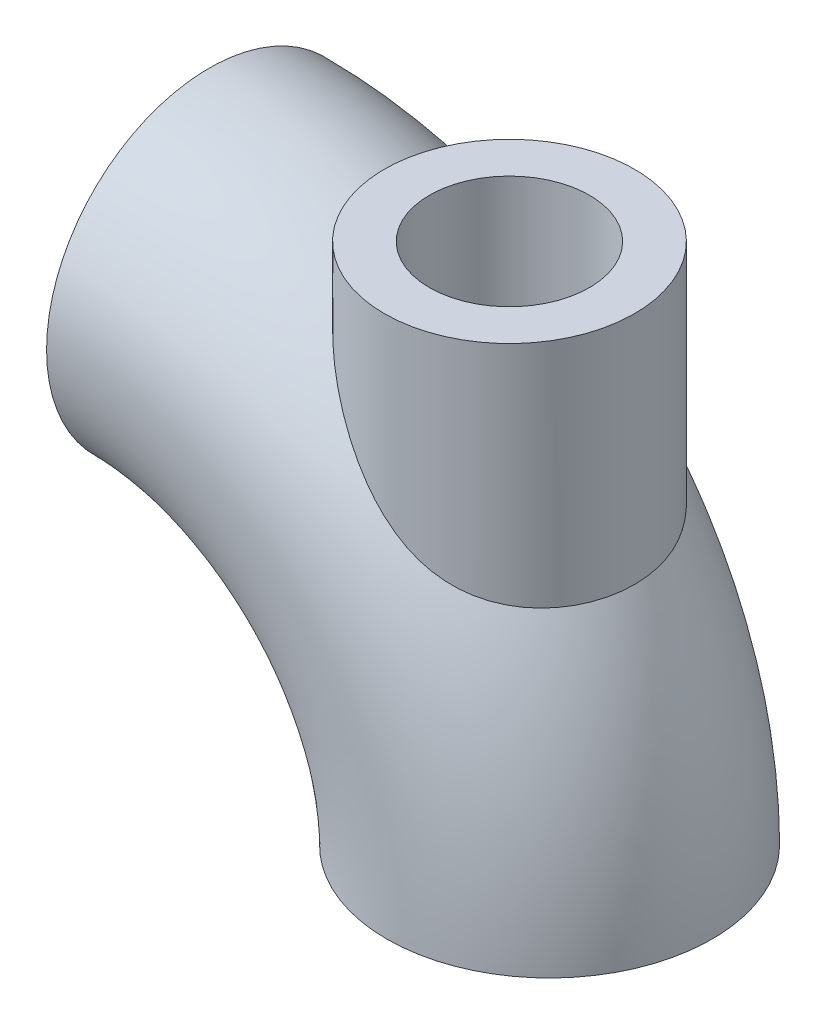
ISO-10303-21;
HEADER;
FILE_DESCRIPTION(('STEP AP214'),'2;1');
FILE_NAME('part.step','',(''),(''),'','','');
FILE_SCHEMA(('AUTOMOTIVE_DESIGN { 1 0 10303 214 1 1 1 1 }'));
ENDSEC;
DATA;
#1=APPLICATION_CONTEXT('core data for automotive mechanical design processes');
#2=APPLICATION_PROTOCOL_DEFINITION('international standard','automotive_design',2000,#1);
#3=PRODUCT_CONTEXT('',#1,'mechanical');
#4=PRODUCT('Part','Part','',(#3));
#5=PRODUCT_RELATED_PRODUCT_CATEGORY('part','',(#4));
#6=PRODUCT_DEFINITION_FORMATION('','',#4);
#7=PRODUCT_DEFINITION_CONTEXT('part definition',#1,'design');
#8=PRODUCT_DEFINITION('design','',#6,#7);
#9=PRODUCT_DEFINITION_SHAPE('','',#8);
#10=(LENGTH_UNIT() NAMED_UNIT(*) SI_UNIT(.MILLI.,.METRE.));
#11=(NAMED_UNIT(*) PLANE_ANGLE_UNIT() SI_UNIT($,.RADIAN.));
#12=(NAMED_UNIT(*) SI_UNIT($,.STERADIAN.) SOLID_ANGLE_UNIT());
#13=UNCERTAINTY_MEASURE_WITH_UNIT(LENGTH_MEASURE(1.E-05),#10,'distance_accuracy_value','');
#14=(GEOMETRIC_REPRESENTATION_CONTEXT(3) GLOBAL_UNCERTAINTY_ASSIGNED_CONTEXT((#13)) GLOBAL_UNIT_ASSIGNED_CONTEXT((#10,
#11,#12)) REPRESENTATION_CONTEXT('',''));
#15=CARTESIAN_POINT('',(0.,0.,0.));
#16=DIRECTION('',(0.,0.,1.));
#17=DIRECTION('',(1.,0.,0.));
#18=AXIS2_PLACEMENT_3D('',#15,#16,#17);
#19=CARTESIAN_POINT('',(-68.,0.,0.));
#20=DIRECTION('',(0.,0.,-1.));
#21=DIRECTION('',(-1.,0.,0.));
#22=AXIS2_PLACEMENT_3D('',#19,#20,#21);
#23=TOROIDAL_SURFACE('',#22,68.,20.);
#24=CARTESIAN_POINT('',(0.251674053511512,46.458689869364,-13.7080222977133));
#25=CARTESIAN_POINT('',(0.579883240702387,46.3070119127707,-13.5104488063518));
#26=CARTESIAN_POINT('',(0.905013391545234,46.1670687579967,-13.2986413226634));
#27=CARTESIAN_POINT('',(1.54464572796947,45.9092450303312,-12.8472967635571));
#28=CARTESIAN_POINT('',(1.85914572640486,45.7913689753574,-12.6077540259615));
#29=CARTESIAN_POINT('',(2.47374917285592,45.5755106213001,-12.1020291615279));
#30=CARTESIAN_POINT('',(2.77383773467794,45.4775485684441,-11.8358203300164));
#31=CARTESIAN_POINT('',(3.35573844524039,45.2992868907994,-11.278717478387));
#32=CARTESIAN_POINT('',(3.63755110468632,45.218986772312,-10.9878241485826));
#33=CARTESIAN_POINT('',(4.17893705828471,45.0738773580956,-10.3844685151367));
#34=CARTESIAN_POINT('',(4.43858871496309,45.0090118937554,-10.0720899223983));
#35=CARTESIAN_POINT('',(4.93437406613024,44.8921118118886,-9.42695517497418));
#36=CARTESIAN_POINT('',(5.17050774611197,44.8400772022766,-9.0941990077188));
#37=CARTESIAN_POINT('',(5.6172299845286,44.7467934258441,-8.41057483469467));
#38=CARTESIAN_POINT('',(5.82782055034193,44.7055434111906,-8.05970825527766));
#39=CARTESIAN_POINT('',(6.22183446259688,44.6320503406775,-7.34213753203489));
#40=CARTESIAN_POINT('',(6.40525706078586,44.5998075328702,-6.97543295236244));
#41=CARTESIAN_POINT('',(6.75119795513024,44.5415616920485,-6.21173769331107));
#42=CARTESIAN_POINT('',(6.91240592914686,44.515904300189,-5.81412658614216));
#43=CARTESIAN_POINT('',(7.20246403487503,44.4714324792229,-5.00689956902898));
#44=CARTESIAN_POINT('',(7.33131335062423,44.4526182226688,-4.59728335665238));
#45=CARTESIAN_POINT('',(7.55572947632467,44.4207792619524,-3.76875426039018));
#46=CARTESIAN_POINT('',(7.65129178795772,44.407755340215,-3.34984012813846));
#47=CARTESIAN_POINT('',(7.8084329024644,44.3867453121045,-2.50556100270997));
#48=CARTESIAN_POINT('',(7.87001121970057,44.3787592777234,-2.08019591743714));
#49=CARTESIAN_POINT('',(7.96022157242804,44.3671599445565,-1.21168523134526));
#50=CARTESIAN_POINT('',(7.9876962824221,44.3637000452235,-0.768416944184042));
#51=CARTESIAN_POINT('',(8.00571104486699,44.361424519783,0.118888199153371));
#52=CARTESIAN_POINT('',(7.99625019030276,44.3626090077262,0.562925073935881));
#53=CARTESIAN_POINT('',(7.94046032816614,44.3696996156558,1.44867162025102));
#54=CARTESIAN_POINT('',(7.89412875588161,44.3756060641,1.89038112774131));
#55=CARTESIAN_POINT('',(7.7649370415422,44.3925198313372,2.76832607859729));
#56=CARTESIAN_POINT('',(7.68207700046105,44.4035271360303,3.20456153709116));
#57=CARTESIAN_POINT('',(7.47993001707069,44.431405126257,4.07069267080586));
#58=CARTESIAN_POINT('',(7.36045789574553,44.4483056803984,4.5005441936349));
#59=CARTESIAN_POINT('',(7.08616001791351,44.4889954130157,5.3484891406377));
#60=CARTESIAN_POINT('',(6.93133393339869,44.5127846554044,5.76658245568042));
#61=CARTESIAN_POINT('',(6.58754180933493,44.5686527300031,6.58801081519642));
#62=CARTESIAN_POINT('',(6.39856970715237,44.6007330347292,6.99134322354989));
#63=CARTESIAN_POINT('',(5.98810213854316,44.6749603221657,7.78014490477518));
#64=CARTESIAN_POINT('',(5.76660706506272,44.7171071832547,8.16561439339479));
#65=CARTESIAN_POINT('',(5.29568831337472,44.8131171790887,8.91162755466653));
#66=CARTESIAN_POINT('',(5.04659635255148,44.8668472211078,9.2723976148262));
#67=CARTESIAN_POINT('',(4.52096109455018,44.9887678618065,9.97078315627513));
#68=CARTESIAN_POINT('',(4.24441773106717,45.0569584954141,10.3083985816343));
#69=CARTESIAN_POINT('',(3.66701628223523,45.2105525486959,10.957614761564));
#70=CARTESIAN_POINT('',(3.36617252740645,45.2959458672943,11.2692306314129));
#71=CARTESIAN_POINT('',(2.74365681901244,45.4869434590673,11.8641964013391));
#72=CARTESIAN_POINT('',(2.4219863255067,45.5925463164641,12.1475482793342));
#73=CARTESIAN_POINT('',(1.7796252522069,45.8206626204229,12.6696915572007));
#74=CARTESIAN_POINT('',(1.45978370352528,45.9419853798179,12.9100475814182));
#75=CARTESIAN_POINT('',(0.809567487822008,46.2074757689163,13.3621964615403));
#76=CARTESIAN_POINT('',(0.479193523500135,46.3516418770986,13.5739912180798));
#77=CARTESIAN_POINT('',(-0.187205663973733,46.6641304512066,13.9681788423492));
#78=CARTESIAN_POINT('',(-0.523226220535772,46.8324337597951,14.1505947861271));
#79=CARTESIAN_POINT('',(-1.19649364470052,47.1937378381569,14.4863324106089));
#80=CARTESIAN_POINT('',(-1.53374047533667,47.3867378693364,14.6396549610555));
#81=CARTESIAN_POINT('',(-2.18107020915887,47.7820470381146,14.9081840709015));
#82=CARTESIAN_POINT('',(-2.49136663894353,47.9826958611934,15.0253356200988));
#83=CARTESIAN_POINT('',(-3.10649403559755,48.4033663573817,15.2367776152165));
#84=CARTESIAN_POINT('',(-3.41132529782902,48.6233869797306,15.3310693000561));
#85=CARTESIAN_POINT('',(-4.01352589590269,49.0809638778267,15.498572653174));
#86=CARTESIAN_POINT('',(-4.31089411461001,49.3185227581253,15.5717811825159));
#87=CARTESIAN_POINT('',(-4.89692235272744,49.8089995218885,15.6990717459209));
#88=CARTESIAN_POINT('',(-5.1855813646602,50.0619191721617,15.7531515748845));
#89=CARTESIAN_POINT('',(-5.72217049849194,50.552099589437,15.8390946805061));
#90=CARTESIAN_POINT('',(-5.97107140597724,50.7879934651296,15.8727548444661));
#91=CARTESIAN_POINT('',(-6.46160307914626,51.2686615948951,15.9277827087778));
#92=CARTESIAN_POINT('',(-6.70323258279266,51.5134373744497,15.9491482867889));
#93=CARTESIAN_POINT('',(-7.17958450530103,52.0106057334975,15.9807364068048));
#94=CARTESIAN_POINT('',(-7.41430210501676,52.263003389899,15.990951345301));
#95=CARTESIAN_POINT('',(-7.87706295526514,52.774002410859,16.0012013881868));
#96=CARTESIAN_POINT('',(-8.10510648724459,53.0326035129777,16.0012369224643));
#97=CARTESIAN_POINT('',(-8.55645099120217,53.5565768880202,15.9919239671556));
#98=CARTESIAN_POINT('',(-8.77971294461455,53.8219815966229,15.9825162466993));
#99=CARTESIAN_POINT('',(-9.22054340959509,54.3570125144336,15.9549065440942));
#100=CARTESIAN_POINT('',(-9.43811191853874,54.6266387255876,15.9367045578915));
#101=CARTESIAN_POINT('',(-9.86804129535707,55.1691991464139,15.8920458251801));
#102=CARTESIAN_POINT('',(-10.0804036687679,55.4421323648039,15.8655914962354));
#103=CARTESIAN_POINT('',(-10.5005117930674,55.9906712766157,15.8048239340841));
#104=CARTESIAN_POINT('',(-10.7082573027567,56.2662771085876,15.7705102913365));
#105=CARTESIAN_POINT('',(-11.2883660625144,57.0464676405934,15.66307254321));
#106=CARTESIAN_POINT('',(-11.655962983592,57.5534155848043,15.581202780049));
#107=CARTESIAN_POINT('',(-12.3799956814476,58.5708517720675,15.393357238491));
#108=CARTESIAN_POINT('',(-12.736429834046,59.0813405172278,15.2873779705364));
#109=CARTESIAN_POINT('',(-13.4404076087609,60.1037253038768,15.0512439462692));
#110=CARTESIAN_POINT('',(-13.7879409236014,60.6156222784805,14.9210624866694));
#111=CARTESIAN_POINT('',(-14.4750358096254,61.6378378756069,14.6359908448986));
#112=CARTESIAN_POINT('',(-14.8145979476431,62.1481566081047,14.4811024257944));
#113=CARTESIAN_POINT('',(-15.4845850878166,63.161948671785,14.1463908208147));
#114=CARTESIAN_POINT('',(-15.8150524496638,63.6654446688288,13.9667215594999));
#115=CARTESIAN_POINT('',(-16.4692375050918,64.6664094030436,13.580000580758));
#116=CARTESIAN_POINT('',(-16.7929544193633,65.1638774415664,13.372945721823));
#117=CARTESIAN_POINT('',(-17.4327891924138,66.1493626010487,12.9295687996369));
#118=CARTESIAN_POINT('',(-17.7489183035085,66.6373934771913,12.6932937409786));
#119=CARTESIAN_POINT('',(-18.3731084905584,67.6016648601189,12.1885075943215));
#120=CARTESIAN_POINT('',(-18.6811724183213,68.0779095310966,11.9200080934986));
#121=CARTESIAN_POINT('',(-19.1866543224654,68.8589533934259,11.4427296956968));
#122=CARTESIAN_POINT('',(-19.3867691641188,69.1680531594254,11.2438215196857));
#123=CARTESIAN_POINT('',(-19.781953770648,69.7780022744386,10.8290187501038));
#124=CARTESIAN_POINT('',(-19.9770237271708,70.0788519368865,10.6131248030578));
#125=CARTESIAN_POINT('',(-20.3613458226139,70.6709340290156,10.1629135040098));
#126=CARTESIAN_POINT('',(-20.5505922238301,70.962156993634,9.92857874355975));
#127=CARTESIAN_POINT('',(-20.9218286556424,71.5326699178218,9.44035965124985));
#128=CARTESIAN_POINT('',(-21.103818669889,71.8119598505046,9.18647527534621));
#129=CARTESIAN_POINT('',(-21.4607583435968,72.3589044057939,8.65514064600163));
#130=CARTESIAN_POINT('',(-21.635617534417,72.6264117377751,8.37747690913698));
#131=CARTESIAN_POINT('',(-21.9742575927428,73.1436342600118,7.79950660033313));
#132=CARTESIAN_POINT('',(-22.1380368361415,73.3933468421844,7.49919672248942));
#133=CARTESIAN_POINT('',(-22.4515929484794,73.8706373813989,6.87554046391114));
#134=CARTESIAN_POINT('',(-22.6013955163031,74.0982559949804,6.55223836888785));
#135=CARTESIAN_POINT('',(-22.8841382120246,74.5271980824955,5.88171920428421));
#136=CARTESIAN_POINT('',(-23.0170877024387,74.728536158117,5.53451557980511));
#137=CARTESIAN_POINT('',(-23.2207963390648,75.0365999243379,4.93863667495585));
#138=CARTESIAN_POINT('',(-23.2973469387752,75.1522426758494,4.69652186590179));
#139=CARTESIAN_POINT('',(-23.4403333465376,75.368065619921,4.20263599887786));
#140=CARTESIAN_POINT('',(-23.506772159088,75.4682504056031,3.9508678371371));
#141=CARTESIAN_POINT('',(-23.6283354587955,75.651427075337,3.43865675380512));
#142=CARTESIAN_POINT('',(-23.6834672189544,75.7344300115411,3.17821953450182));
#143=CARTESIAN_POINT('',(-23.781344079373,75.8817037739929,2.64978612443474));
#144=CARTESIAN_POINT('',(-23.8240890001784,75.9459743288553,2.38178982422052));
#145=CARTESIAN_POINT('',(-23.8964841755331,76.0547835350074,1.83783595012664));
#146=CARTESIAN_POINT('',(-23.9260296041006,76.0991642361693,1.56183255932241));
#147=CARTESIAN_POINT('',(-23.9707729340308,76.1663601075805,1.00604357553352));
#148=CARTESIAN_POINT('',(-23.9859709567338,76.1891754602145,0.726258014556141));
#149=CARTESIAN_POINT('',(-24.0016037004,76.2126432694942,0.165407594714142));
#150=CARTESIAN_POINT('',(-24.0020418574311,76.2133008844179,-0.115656951167201));
#151=CARTESIAN_POINT('',(-23.9881497334985,76.192446349183,-0.676581634648807));
#152=CARTESIAN_POINT('',(-23.9738202830348,76.1709354457368,-0.956441839090014));
#153=CARTESIAN_POINT('',(-23.9329632134646,76.1095780507171,-1.48444916015975));
#154=CARTESIAN_POINT('',(-23.9078114673255,76.0717994046821,-1.73294824843188));
#155=CARTESIAN_POINT('',(-23.846424429154,75.9795492928928,-2.22539769798944));
#156=CARTESIAN_POINT('',(-23.810190262949,75.925079522735,-2.46934851864923));
#157=CARTESIAN_POINT('',(-23.7273269811673,75.8004362407695,-2.95144534290876));
#158=CARTESIAN_POINT('',(-23.680695322599,75.730258887226,-3.18958991059636));
#159=CARTESIAN_POINT('',(-23.5778517520154,75.5753726841425,-3.65900372617647));
#160=CARTESIAN_POINT('',(-23.5216375794258,75.4906604056929,-3.8902713365983));
#161=CARTESIAN_POINT('',(-23.3766941015435,75.2720538174676,-4.43448753955856));
#162=CARTESIAN_POINT('',(-23.2838644350664,75.131908527181,-4.74385322269917));
#163=CARTESIAN_POINT('',(-23.0836523714274,74.8292438055284,-5.34643533094642));
#164=CARTESIAN_POINT('',(-22.9762649073869,74.6667165837606,-5.63964608309159));
#165=CARTESIAN_POINT('',(-22.6351989796666,74.149772808701,-6.49525259502075));
#166=CARTESIAN_POINT('',(-22.3828172290202,73.766295517252,-7.03290513764104));
#167=CARTESIAN_POINT('',(-21.9026778300038,73.0344948464678,-7.93193174517853));
#168=CARTESIAN_POINT('',(-21.6816692573746,72.6969223281066,-8.30609868720648));
#169=CARTESIAN_POINT('',(-21.2232267281498,71.9951544056235,-9.01806281813176));
#170=CARTESIAN_POINT('',(-20.9857831703097,71.6309434322726,-9.35583844777389));
#171=CARTESIAN_POINT('',(-20.4980221713174,70.8813787818105,-9.99811892416891));
#172=CARTESIAN_POINT('',(-20.247684635888,70.4959920373785,-10.3025693782065));
#173=CARTESIAN_POINT('',(-19.7372177704113,69.709069937324,-10.8805478752379));
#174=CARTESIAN_POINT('',(-19.4770895868502,69.3075364721101,-11.1540795239032));
#175=CARTESIAN_POINT('',(-18.9757364225663,68.5331177723306,-11.6466227045903));
#176=CARTESIAN_POINT('',(-18.7352694031519,68.1614563429765,-11.8683501316332));
#177=CARTESIAN_POINT('',(-18.2488918139375,67.4097845067116,-12.2908091670372));
#178=CARTESIAN_POINT('',(-18.0029803530284,67.0297727331507,-12.4915373071328));
#179=CARTESIAN_POINT('',(-17.5062267514865,66.2628550427592,-12.8736127653081));
#180=CARTESIAN_POINT('',(-17.2553811181414,65.8759442619308,-13.0549457235411));
#181=CARTESIAN_POINT('',(-16.7493261605706,65.0969462119409,-13.3993642430519));
#182=CARTESIAN_POINT('',(-16.4941170550416,64.7048592024343,-13.5624507157689));
#183=CARTESIAN_POINT('',(-15.978691486547,63.9155643028802,-13.8719543180626));
#184=CARTESIAN_POINT('',(-15.7184622716741,63.5183445577079,-14.0183198361062));
#185=CARTESIAN_POINT('',(-15.1936646558539,62.7211026681248,-14.2947243396335));
#186=CARTESIAN_POINT('',(-14.9290961776495,62.3210804738915,-14.4247630340734));
#187=CARTESIAN_POINT('',(-14.3954590430704,61.5195337442,-14.6691577774436));
#188=CARTESIAN_POINT('',(-14.1263924443318,61.1180099575444,-14.7835207881624));
#189=CARTESIAN_POINT('',(-13.5831579829091,60.314402531826,-14.9971177004988));
#190=CARTESIAN_POINT('',(-13.3089902402822,59.9123189061448,-15.0963519576731));
#191=CARTESIAN_POINT('',(-12.7986971179572,59.1723475628629,-15.2654134393996));
#192=CARTESIAN_POINT('',(-12.5634175243848,58.8343702354233,-15.3374091975642));
#193=CARTESIAN_POINT('',(-12.0882046354122,58.1596107969389,-15.4708597249989));
#194=CARTESIAN_POINT('',(-11.8482714265375,57.8228286638092,-15.5323146900468));
#195=CARTESIAN_POINT('',(-11.3630066287621,57.1511724531035,-15.6445592523682));
#196=CARTESIAN_POINT('',(-11.1176729742866,56.8162991695196,-15.6953446875839));
#197=CARTESIAN_POINT('',(-10.6209407030664,56.1495651275626,-15.7858927890917));
#198=CARTESIAN_POINT('',(-10.3695421322851,55.8177043463853,-15.8256555388913));
#199=CARTESIAN_POINT('',(-9.86075529556535,55.1593342678534,-15.8934961603523));
#200=CARTESIAN_POINT('',(-9.60339238963776,54.8328098034169,-15.9216163679844));
#201=CARTESIAN_POINT('',(-9.08085331806901,54.1851768045657,-15.9656040342972));
#202=CARTESIAN_POINT('',(-8.81567672830606,53.8640685656333,-15.9814708265937));
#203=CARTESIAN_POINT('',(-8.27677236133268,53.2291017902374,-15.9998761590972));
#204=CARTESIAN_POINT('',(-8.00305128956462,52.9152378891865,-16.0024248988987));
#205=CARTESIAN_POINT('',(-7.44601615460377,52.2964342037791,-15.9928321452727));
#206=CARTESIAN_POINT('',(-7.16270392039125,51.9914927384122,-15.9806934374903));
#207=CARTESIAN_POINT('',(-6.55923801614523,51.3651927841751,-15.9381279512961));
#208=CARTESIAN_POINT('',(-6.23808788386226,51.0448919127747,-15.9061267018528));
#209=CARTESIAN_POINT('',(-5.58294791169677,50.4207222315935,-15.8198288894741));
#210=CARTESIAN_POINT('',(-5.24895815646316,50.116853313512,-15.7655324735034));
#211=CARTESIAN_POINT('',(-4.56934018212486,49.529808948925,-15.6317057060511));
#212=CARTESIAN_POINT('',(-4.22374035553886,49.2465877240703,-15.5522334036544));
#213=CARTESIAN_POINT('',(-3.52190313482271,48.7037101765695,-15.3648427633185));
#214=CARTESIAN_POINT('',(-3.16566926713037,48.4440461548158,-15.2569337645821));
#215=CARTESIAN_POINT('',(-2.5538909243651,48.0253100157292,-15.0469537295546));
#216=CARTESIAN_POINT('',(-2.30022936878432,47.859444104417,-14.9528580584908));
#217=CARTESIAN_POINT('',(-1.79078965423797,47.541459148082,-14.7485926148329));
#218=CARTESIAN_POINT('',(-1.53501181869408,47.3893380433635,-14.6384252571145));
#219=CARTESIAN_POINT('',(-1.02295965167156,47.0991776393209,-14.4014071978735));
#220=CARTESIAN_POINT('',(-0.766685118739929,46.9611465251076,-14.2745468959824));
#221=CARTESIAN_POINT('',(-0.255773358587455,46.6993188512022,-14.0039475821005));
#222=CARTESIAN_POINT('',(-0.00113622770097689,46.5755231219256,-13.8602075864273));
#223=CARTESIAN_POINT('',(0.251674053511512,46.458689869364,-13.7080222977133));
#224=B_SPLINE_CURVE_WITH_KNOTS('',3,(#24,#25,#26,#27,#28,#29,#30,#31,#32,#33,#34,#35,#36,#37,
#38,#39,#40,#41,#42,#43,#44,#45,#46,#47,#48,#49,#50,#51,#52,#53,#54,#55,#56,#57,#58,#59,#60,#61,
#62,#63,#64,#65,#66,#67,#68,#69,#70,#71,#72,#73,#74,#75,#76,#77,#78,#79,#80,#81,#82,#83,#84,#85,
#86,#87,#88,#89,#90,#91,#92,#93,#94,#95,#96,#97,#98,#99,#100,#101,#102,#103,#104,#105,#106,#107,
#108,#109,#110,#111,#112,#113,#114,#115,#116,#117,#118,#119,#120,#121,#122,#123,#124,#125,#126,
#127,#128,#129,#130,#131,#132,#133,#134,#135,#136,#137,#138,#139,#140,#141,#142,#143,#144,#145,
#146,#147,#148,#149,#150,#151,#152,#153,#154,#155,#156,#157,#158,#159,#160,#161,#162,#163,#164,
#165,#166,#167,#168,#169,#170,#171,#172,#173,#174,#175,#176,#177,#178,#179,#180,#181,#182,#183,
#184,#185,#186,#187,#188,#189,#190,#191,#192,#193,#194,#195,#196,#197,#198,#199,#200,#201,#202,
#203,#204,#205,#206,#207,#208,#209,#210,#211,#212,#213,#214,#215,#216,#217,#218,#219,#220,#221,
#222,#223),.UNSPECIFIED.,.T.,.F.,(4,2,2,2,2,2,2,2,2,2,2,2,2,2,2,2,2,2,2,2,2,2,2,2,2,2,2,2,2,2,2,
2,2,2,2,2,2,2,2,2,2,2,2,2,2,2,2,2,2,2,2,2,2,2,2,2,2,2,2,2,2,2,2,2,2,2,2,2,2,2,2,2,2,2,2,2,2,2,2,
2,2,2,2,2,2,2,2,2,2,2,2,2,2,2,2,2,2,2,2,4),(0.,1.23574601934018,2.47174476367838,
3.70899391049281,4.94620846845607,6.1788493293815,7.41149095065616,8.64403563842437,
9.8766142662866,11.164599543023,12.4526172945915,13.7408090380242,15.0290191894743,
16.3598460532561,17.690705597941,19.0216577247679,20.3526061725375,21.6904007038695,
23.0282076475326,24.3662523529533,25.7042808932966,27.0276849103967,28.3510921240679,
29.6737245124326,30.9962642777804,32.2488135814002,33.5012794918342,34.7527567842166,
36.0041966579749,37.165885974542,38.3275123178083,39.4893115188936,40.6512446051026,
41.6845249608,42.7179836320173,43.7521465689033,44.7862658319048,45.8269121797352,
46.8675590072644,47.9079012580638,48.9482977323962,50.842201992741,52.7363805473022,
54.6326615666481,56.5288073295397,58.413665412758,60.2987399031729,62.1808205089537,
64.0622263776427,65.3173762717553,66.5724784145191,67.8287799461573,69.0850843082306,
70.3541705722171,71.6234424585677,72.8903325432615,74.1565157095078,74.9929028955152,
75.8290410799835,76.6646397392214,77.5002505035865,78.3423843135569,79.1845110012791,
80.026441642197,80.868324937234,81.6253072706083,82.3822127301121,83.139303515038,
83.8965731501552,84.9511808371501,86.0061565299892,88.1184889171681,89.7673053148276,
91.417093208641,93.0695349180226,94.7217837246633,96.2064887186056,97.6914385422132,
99.1774802948216,100.663447784258,102.15388460357,103.644347987796,105.134147276862,
106.623911547185,107.877920923001,109.131907005138,110.386381347924,111.640846186612,
112.890708457521,114.140638695587,115.389611537491,116.638347534303,118.00155592798,
119.364755335853,120.724834159917,122.084466861271,123.035864990673,123.987120313259,
124.938925128221,125.890785438197),.UNSPECIFIED.);
#225=CARTESIAN_POINT('',(0.251674053511512,46.458689869364,-13.7080222977133));
#226=VERTEX_POINT('',#225);
#227=EDGE_CURVE('E62',#226,#226,#224,.T.);
#228=ORIENTED_EDGE('',*,*,#227,.F.);
#229=EDGE_LOOP('',(#228));
#230=FACE_BOUND('',#229,.T.);
#231=CARTESIAN_POINT('',(-68.,68.,0.));
#232=DIRECTION('',(-1.,0.,0.));
#233=DIRECTION('',(0.,0.,1.));
#234=AXIS2_PLACEMENT_3D('',#231,#232,#233);
#235=CIRCLE('',#234,20.);
#236=CARTESIAN_POINT('',(-68.,68.,20.));
#237=VERTEX_POINT('',#236);
#238=EDGE_CURVE('E39',#237,#237,#235,.T.);
#239=ORIENTED_EDGE('',*,*,#238,.T.);
#240=EDGE_LOOP('',(#239));
#241=FACE_BOUND('',#240,.T.);
#242=CARTESIAN_POINT('',(0.,0.,0.));
#243=DIRECTION('',(0.,1.,0.));
#244=DIRECTION('',(0.,0.,1.));
#245=AXIS2_PLACEMENT_3D('',#242,#243,#244);
#246=CIRCLE('',#245,20.);
#247=CARTESIAN_POINT('',(0.,0.,20.));
#248=VERTEX_POINT('',#247);
#249=EDGE_CURVE('E47',#248,#248,#246,.T.);
#250=ORIENTED_EDGE('',*,*,#249,.F.);
#251=EDGE_LOOP('',(#250));
#252=FACE_BOUND('',#251,.T.);
#253=ADVANCED_FACE('F32',(#230,#241,#252),#23,.F.);
#254=CARTESIAN_POINT('',(-68.,0.,0.));
#255=DIRECTION('',(0.,0.,-1.));
#256=DIRECTION('',(-1.,0.,0.));
#257=AXIS2_PLACEMENT_3D('',#254,#255,#256);
#258=TOROIDAL_SURFACE('',#257,68.,32.5);
#259=CARTESIAN_POINT('',(-7.01580041526171,64.533465892096,-24.9806195114813));
#260=CARTESIAN_POINT('',(-7.50000163833847,64.9594961827475,-24.9996962259398));
#261=CARTESIAN_POINT('',(-7.9777575639453,65.3934306288262,-25.0044381305077));
#262=CARTESIAN_POINT('',(-8.92094143093466,66.274107440392,-24.9874846183522));
#263=CARTESIAN_POINT('',(-9.38636699447698,66.7208522421879,-24.9657841397415));
#264=CARTESIAN_POINT('',(-10.3059268531832,67.6246442397286,-24.8976991548612));
#265=CARTESIAN_POINT('',(-10.7600519102201,68.0816993175322,-24.8512951052859));
#266=CARTESIAN_POINT('',(-11.6575211998291,69.0032793876033,-24.7351421067268));
#267=CARTESIAN_POINT('',(-12.1008660000686,69.4678039843911,-24.6653943898429));
#268=CARTESIAN_POINT('',(-12.979857527246,70.4044359962531,-24.5030961792109));
#269=CARTESIAN_POINT('',(-13.415456415573,70.8765692802675,-24.4104365955119));
#270=CARTESIAN_POINT('',(-14.2776036251464,71.8242375713167,-24.2030630407496));
#271=CARTESIAN_POINT('',(-14.7041518431774,72.2997726170632,-24.0883488183215));
#272=CARTESIAN_POINT('',(-15.5487637566158,73.2522725204222,-23.8371600150919));
#273=CARTESIAN_POINT('',(-15.9668307294463,73.7292367407056,-23.7006940276555));
#274=CARTESIAN_POINT('',(-16.7952221803384,74.6831386646221,-23.4059252763254));
#275=CARTESIAN_POINT('',(-17.2055466679681,75.1600763682872,-23.2476225394194));
#276=CARTESIAN_POINT('',(-18.0314880059042,76.1271837207069,-22.903614550836));
#277=CARTESIAN_POINT('',(-18.4468724769462,76.6173035013402,-22.7172101046105));
#278=CARTESIAN_POINT('',(-19.2700120743174,77.5942002950944,-22.3202956587776));
#279=CARTESIAN_POINT('',(-19.677767121527,78.0809772735162,-22.1097854093461));
#280=CARTESIAN_POINT('',(-20.4857714074921,79.0497293388976,-21.6637614631673));
#281=CARTESIAN_POINT('',(-20.8860170901771,79.5317021025816,-21.4282362554975));
#282=CARTESIAN_POINT('',(-21.6784727809888,80.4888589685416,-20.9312712709705));
#283=CARTESIAN_POINT('',(-22.0706829403141,80.9640431985016,-20.6698319822613));
#284=CARTESIAN_POINT('',(-22.8443177892631,81.9031661196558,-20.1213771157135));
#285=CARTESIAN_POINT('',(-23.2257899493853,82.367152300729,-19.8345101809651));
#286=CARTESIAN_POINT('',(-23.9792723829899,83.2845697088722,-19.2326638252738));
#287=CARTESIAN_POINT('',(-24.3512820308359,83.7380002378633,-18.917682551661));
#288=CARTESIAN_POINT('',(-25.0841674578201,84.6315646078028,-18.2585291665998));
#289=CARTESIAN_POINT('',(-25.4450536807015,85.0717109126487,-17.9143856492122));
#290=CARTESIAN_POINT('',(-26.1542944941156,85.9364744530913,-17.1952484922193));
#291=CARTESIAN_POINT('',(-26.5026520595982,86.3610953756186,-16.8202622467154));
#292=CARTESIAN_POINT('',(-27.1744468622082,87.1793533269875,-16.049731122135));
#293=CARTESIAN_POINT('',(-27.498319157561,87.573539046356,-15.655151134068));
#294=CARTESIAN_POINT('',(-28.1298664591132,88.3413963418216,-14.8343044979514));
#295=CARTESIAN_POINT('',(-28.4375429642411,88.7150698164746,-14.4080407910845));
#296=CARTESIAN_POINT('',(-29.0336925600169,89.4381822845462,-13.5228851533359));
#297=CARTESIAN_POINT('',(-29.3221703180672,89.7876271690411,-13.064001209269));
#298=CARTESIAN_POINT('',(-29.8764643269416,90.4581397882226,-12.1129319803741));
#299=CARTESIAN_POINT('',(-30.1422834814176,90.7792111591089,-11.6207509770364));
#300=CARTESIAN_POINT('',(-30.6089419263279,91.3420772830968,-10.6802629426229));
#301=CARTESIAN_POINT('',(-30.8135259459551,91.5885147850117,-10.2365960009416));
#302=CARTESIAN_POINT('',(-31.2006324441611,92.054276120715,-9.32605278955096));
#303=CARTESIAN_POINT('',(-31.3831601456942,92.2736063738037,-8.85918205162145));
#304=CARTESIAN_POINT('',(-31.7230986079322,92.6816524260634,-7.90388409008696));
#305=CARTESIAN_POINT('',(-31.8805310138393,92.8703946104351,-7.41547591232452));
#306=CARTESIAN_POINT('',(-32.1674591545328,93.2140721745286,-6.41892471930243));
#307=CARTESIAN_POINT('',(-32.2969594375992,93.369013058275,-5.91078493293134));
#308=CARTESIAN_POINT('',(-32.5079513130383,93.6212723428506,-4.95600151791427));
#309=CARTESIAN_POINT('',(-32.5937405083141,93.7237601808161,-4.5116686971211));
#310=CARTESIAN_POINT('',(-32.7416552018072,93.9003843596848,-3.61352238627484));
#311=CARTESIAN_POINT('',(-32.8037830262624,93.9745234876587,-3.15970983283956));
#312=CARTESIAN_POINT('',(-32.9031748871732,94.0930975725319,-2.24568886016046));
#313=CARTESIAN_POINT('',(-32.9404486109672,94.1375441026749,-1.78548300430491));
#314=CARTESIAN_POINT('',(-32.9894229864119,94.1959377015481,-0.861765051484157));
#315=CARTESIAN_POINT('',(-33.0011232249575,94.209884277593,-0.398252901231596));
#316=CARTESIAN_POINT('',(-32.9987057518116,94.2070023624511,0.529029328143003));
#317=CARTESIAN_POINT('',(-32.9845645531647,94.1901458747493,0.992799258532557));
#318=CARTESIAN_POINT('',(-32.9307110142207,94.1259323453447,1.91671359280524));
#319=CARTESIAN_POINT('',(-32.8909986744637,94.0785753042859,2.37685799676493));
#320=CARTESIAN_POINT('',(-32.7867861048217,93.9542410839764,3.29038996426278));
#321=CARTESIAN_POINT('',(-32.722279034878,93.8772557312317,3.74377562740066));
#322=CARTESIAN_POINT('',(-32.569701283475,93.6950439785366,4.64077422915271));
#323=CARTESIAN_POINT('',(-32.4816300755771,93.5898169476482,5.08438694919316));
#324=CARTESIAN_POINT('',(-32.2834046076513,93.3527884514046,5.95967898955888));
#325=CARTESIAN_POINT('',(-32.1732365261888,93.2209703532318,6.39135064757025));
#326=CARTESIAN_POINT('',(-31.9325997206027,92.9327787429362,7.24054280109112));
#327=CARTESIAN_POINT('',(-31.8021315133861,92.7764058560572,7.65806365659637));
#328=CARTESIAN_POINT('',(-31.5226843903543,92.4411345660182,8.47766687208589));
#329=CARTESIAN_POINT('',(-31.37370093558,92.2622306392951,8.87974541468328));
#330=CARTESIAN_POINT('',(-31.0590553674549,91.8839892729229,9.6674684499955));
#331=CARTESIAN_POINT('',(-30.8933894207659,91.684647136747,10.0531091364783));
#332=CARTESIAN_POINT('',(-30.4505137728552,91.1511539864905,11.0178181247899));
#333=CARTESIAN_POINT('',(-30.1626360078097,90.8038367539924,11.5847736848964));
#334=CARTESIAN_POINT('',(-29.5567030092604,90.0715257929761,12.6767059947333));
#335=CARTESIAN_POINT('',(-29.2386340536497,89.6865149299176,13.2016634543449));
#336=CARTESIAN_POINT('',(-28.5770042764905,88.8843830415207,14.210968526055));
#337=CARTESIAN_POINT('',(-28.2333999603159,88.4672071817457,14.6952437105392));
#338=CARTESIAN_POINT('',(-27.5255108630007,87.6066568453949,15.6235460104679));
#339=CARTESIAN_POINT('',(-27.1612264262842,87.1632828051403,16.0675737959065));
#340=CARTESIAN_POINT('',(-26.502511092029,86.360894288684,16.8179899816115));
#341=CARTESIAN_POINT('',(-26.2116176994662,86.0063393284941,17.132317029809));
#342=CARTESIAN_POINT('',(-25.6209282350093,85.2861704232085,17.7392853402732));
#343=CARTESIAN_POINT('',(-25.3211311621568,84.920555234627,18.0319241513068));
#344=CARTESIAN_POINT('',(-24.7135787691492,84.1797060133512,18.5964599234887));
#345=CARTESIAN_POINT('',(-24.4058198620115,83.8044676458877,18.8683473098346));
#346=CARTESIAN_POINT('',(-23.7833153412939,83.0459305082664,19.3920705507114));
#347=CARTESIAN_POINT('',(-23.4685699314433,82.6626319731635,19.6439069889567));
#348=CARTESIAN_POINT('',(-22.8316983602448,81.8879589184698,20.1291208459275));
#349=CARTESIAN_POINT('',(-22.5095514994561,81.496562162318,20.3624354752706));
#350=CARTESIAN_POINT('',(-21.8593265943152,80.7080258049835,20.810453125144));
#351=CARTESIAN_POINT('',(-21.5312479645762,80.310885637785,21.0251542965231));
#352=CARTESIAN_POINT('',(-20.8695887711935,79.5120513598816,21.4365439699578));
#353=CARTESIAN_POINT('',(-20.5360092997396,79.1103581580161,21.6332359980932));
#354=CARTESIAN_POINT('',(-19.8635024221135,78.3033860911739,22.0092184211676));
#355=CARTESIAN_POINT('',(-19.5245753329367,77.8981074393561,22.1885098431058));
#356=CARTESIAN_POINT('',(-18.739047443821,76.9630613523714,22.581393399203));
#357=CARTESIAN_POINT('',(-18.2906139254867,76.4323801339826,22.7891655996765));
#358=CARTESIAN_POINT('',(-17.3846020751493,75.368666917602,23.1769727559629));
#359=CARTESIAN_POINT('',(-16.9270232236001,74.8356347874032,23.3570061308448));
#360=CARTESIAN_POINT('',(-16.0019248823878,73.7690423079384,23.6898929821935));
#361=CARTESIAN_POINT('',(-15.5343989105959,73.2354818445931,23.8427280870161));
#362=CARTESIAN_POINT('',(-14.588923958692,72.1705037887352,24.1211307144888));
#363=CARTESIAN_POINT('',(-14.1109752785591,71.6390861350699,24.2466990207759));
#364=CARTESIAN_POINT('',(-13.1451271419139,70.5825735942473,24.4698295984514));
#365=CARTESIAN_POINT('',(-12.6572642093186,70.0574639639069,24.5674797581585));
#366=CARTESIAN_POINT('',(-11.6688507216283,69.0146101195426,24.7344046902675));
#367=CARTESIAN_POINT('',(-11.1682992613032,68.4968664351604,24.8036774320717));
#368=CARTESIAN_POINT('',(-10.1537475215506,67.4725030890031,24.9122739145014));
#369=CARTESIAN_POINT('',(-9.63976160909896,66.9658725301117,24.951628395464));
#370=CARTESIAN_POINT('',(-8.59675344752273,65.9669647764586,24.9983265636505));
#371=CARTESIAN_POINT('',(-8.06773480344013,65.4746841968062,25.0056778615187));
#372=CARTESIAN_POINT('',(-6.98455813498783,64.5003101970195,24.9853406729569));
#373=CARTESIAN_POINT('',(-6.43012579922839,64.0185315828382,24.9570552312236));
#374=CARTESIAN_POINT('',(-5.30462541310273,63.0789241697033,24.8606891258705));
#375=CARTESIAN_POINT('',(-4.73355932199566,62.6210925676939,24.7926131312395));
#376=CARTESIAN_POINT('',(-3.57692570262927,61.7352903596646,24.6125623165473));
#377=CARTESIAN_POINT('',(-2.9913867805021,61.3072663762711,24.500668474441));
#378=CARTESIAN_POINT('',(-1.80767277489537,60.4851571541299,24.2285725745701));
#379=CARTESIAN_POINT('',(-1.20949779479103,60.0910716378664,24.0683709118681));
#380=CARTESIAN_POINT('',(0.00163472736119897,59.3367075872189,23.6934625374801));
#381=CARTESIAN_POINT('',(0.614683320489159,58.9768774276642,23.4781413603005));
#382=CARTESIAN_POINT('',(1.8415967401694,58.2992438851783,22.9908345948949));
#383=CARTESIAN_POINT('',(2.45546156250535,57.9814402859992,22.7188492982531));
#384=CARTESIAN_POINT('',(3.67556388323683,57.3887234595091,22.1166022184876));
#385=CARTESIAN_POINT('',(4.28179917619008,57.1138223834512,21.7863239813311));
#386=CARTESIAN_POINT('',(5.47718631422348,56.6058981065336,21.0677851160522));
#387=CARTESIAN_POINT('',(6.0663394247731,56.372871796857,20.6795287961919));
#388=CARTESIAN_POINT('',(7.14727352698041,55.9722250270015,19.8984511628258));
#389=CARTESIAN_POINT('',(7.64209105488936,55.8000806306044,19.5121216854954));
#390=CARTESIAN_POINT('',(8.60608926729737,55.4830875664319,18.6985426102758));
#391=CARTESIAN_POINT('',(9.07527238970422,55.3382362997797,18.2712969143158));
#392=CARTESIAN_POINT('',(9.98314541119746,55.0728388227091,17.3784904808564));
#393=CARTESIAN_POINT('',(10.421831281461,54.9522958195378,16.9129246987779));
#394=CARTESIAN_POINT('',(11.2643981052631,54.7325129011238,15.946596213941));
#395=CARTESIAN_POINT('',(11.6682778277188,54.6332737392064,15.4458322673707));
#396=CARTESIAN_POINT('',(12.4394844614279,54.4527899516545,14.4099446349966));
#397=CARTESIAN_POINT('',(12.8066216869929,54.3716362938401,13.8746639705817));
#398=CARTESIAN_POINT('',(13.4989781059171,54.2253093191568,12.7755935546627));
#399=CARTESIAN_POINT('',(13.8241976747312,54.1601358591491,12.2118040585741));
#400=CARTESIAN_POINT('',(14.4301726955055,54.0434649256063,11.0594379182111));
#401=CARTESIAN_POINT('',(14.7109263422908,53.9919680072377,10.470860268844));
#402=CARTESIAN_POINT('',(15.2258602928325,53.9007165141911,9.27278766261568));
#403=CARTESIAN_POINT('',(15.460039195333,53.8609622927885,8.66329207706056));
#404=CARTESIAN_POINT('',(15.8895941466116,53.7900642566707,7.39949355954823));
#405=CARTESIAN_POINT('',(16.0827496389283,53.7593884564738,6.74440856177511));
#406=CARTESIAN_POINT('',(16.4148869989717,53.7077669579741,5.42026326035984));
#407=CARTESIAN_POINT('',(16.5538673297423,53.6868215357201,4.7512025607926));
#408=CARTESIAN_POINT('',(16.7766347892473,53.6536922032067,3.40364634626702));
#409=CARTESIAN_POINT('',(16.8604143677691,53.6415094914668,2.72514955361905));
#410=CARTESIAN_POINT('',(16.9721363628764,53.6253366701241,1.36347951707612));
#411=CARTESIAN_POINT('',(17.0000785802866,53.6213465897451,0.680306256508659));
#412=CARTESIAN_POINT('',(16.9999198053247,53.6213690092761,-0.697193898965595));
#413=CARTESIAN_POINT('',(16.9708967795059,53.6255131691785,-1.39152086981905));
#414=CARTESIAN_POINT('',(16.8551803238719,53.6422702867709,-2.77525732064442));
#415=CARTESIAN_POINT('',(16.7684860907185,53.6548833624296,-3.46466673198138));
#416=CARTESIAN_POINT('',(16.5380775793989,53.6891927140847,-4.8336932894934));
#417=CARTESIAN_POINT('',(16.3943610001254,53.7108893566456,-5.51331003934357));
#418=CARTESIAN_POINT('',(16.0510110025559,53.7644003646667,-6.8578633699124));
#419=CARTESIAN_POINT('',(15.8513777813967,53.7962146944567,-7.52280000237761));
#420=CARTESIAN_POINT('',(15.3976512495454,53.8714516691082,-8.83352158091496));
#421=CARTESIAN_POINT('',(15.1435313871879,53.9148799760905,-9.47929701433651));
#422=CARTESIAN_POINT('',(14.5829539114378,54.0152686588699,-10.7466403492193));
#423=CARTESIAN_POINT('',(14.2764960358989,54.0722291024461,-11.3682081294121));
#424=CARTESIAN_POINT('',(13.6138359553453,54.2020838105274,-12.5825488042958));
#425=CARTESIAN_POINT('',(13.2576312875162,54.2749788640082,-13.175320271408));
#426=CARTESIAN_POINT('',(12.4987078089783,54.4395613636117,-14.3275549466538));
#427=CARTESIAN_POINT('',(12.0959897599815,54.5312485020107,-14.8870187000134));
#428=CARTESIAN_POINT('',(11.2544604824685,54.7351152602298,-15.9600585910844));
#429=CARTESIAN_POINT('',(10.8162981585463,54.8469587241921,-16.4742072724738));
#430=CARTESIAN_POINT('',(9.90313726437892,55.0954662192651,-17.462248968906));
#431=CARTESIAN_POINT('',(9.42813909800972,55.232129978263,-17.9361424251963));
#432=CARTESIAN_POINT('',(8.44690177895091,55.5337025436836,-18.8399585888972));
#433=CARTESIAN_POINT('',(7.94068291325801,55.6985931296684,-19.2699093771827));
#434=CARTESIAN_POINT('',(6.90283253445597,56.059997823907,-20.0833313386165));
#435=CARTESIAN_POINT('',(6.37120238727364,56.2565102337407,-20.4668050061299));
#436=CARTESIAN_POINT('',(5.31426712656898,56.674027140701,-21.168704662141));
#437=CARTESIAN_POINT('',(4.78979960946481,56.8934855665561,-21.4893139376409));
#438=CARTESIAN_POINT('',(3.73018633505769,57.3651524430728,-22.0855674654802));
#439=CARTESIAN_POINT('',(3.19504116623654,57.6173590930645,-22.361214188219));
#440=CARTESIAN_POINT('',(2.12042415210193,58.1548310110039,-22.8676586503424));
#441=CARTESIAN_POINT('',(1.58095362544464,58.4400865353607,-23.098469554944));
#442=CARTESIAN_POINT('',(0.50321195804569,59.0428538312933,-23.5165811819682));
#443=CARTESIAN_POINT('',(-0.0350591219233794,59.3603672009417,-23.7038797472517));
#444=CARTESIAN_POINT('',(-1.12870713925176,60.039966160578,-24.0442800122255));
#445=CARTESIAN_POINT('',(-1.68382085128205,60.4033833435007,-24.1955588855973));
#446=CARTESIAN_POINT('',(-2.78353133353865,61.1597742663634,-24.4562451346531));
#447=CARTESIAN_POINT('',(-3.32812774492823,61.5527490125381,-24.5656510840752));
#448=CARTESIAN_POINT('',(-4.4048487690187,62.3647238802402,-24.7461763322387));
#449=CARTESIAN_POINT('',(-4.93696023641444,62.7837498739658,-24.8172568690224));
#450=CARTESIAN_POINT('',(-5.98703982069322,63.6434056542734,-24.9244180585972));
#451=CARTESIAN_POINT('',(-6.50500646814005,64.0840376722074,-24.9604950883862));
#452=CARTESIAN_POINT('',(-7.01580041526171,64.533465892096,-24.9806195114813));
#453=B_SPLINE_CURVE_WITH_KNOTS('',3,(#259,#260,#261,#262,#263,#264,#265,#266,#267,#268,#269,
#270,#271,#272,#273,#274,#275,#276,#277,#278,#279,#280,#281,#282,#283,#284,#285,#286,#287,#288,
#289,#290,#291,#292,#293,#294,#295,#296,#297,#298,#299,#300,#301,#302,#303,#304,#305,#306,#307,
#308,#309,#310,#311,#312,#313,#314,#315,#316,#317,#318,#319,#320,#321,#322,#323,#324,#325,#326,
#327,#328,#329,#330,#331,#332,#333,#334,#335,#336,#337,#338,#339,#340,#341,#342,#343,#344,#345,
#346,#347,#348,#349,#350,#351,#352,#353,#354,#355,#356,#357,#358,#359,#360,#361,#362,#363,#364,
#365,#366,#367,#368,#369,#370,#371,#372,#373,#374,#375,#376,#377,#378,#379,#380,#381,#382,#383,
#384,#385,#386,#387,#388,#389,#390,#391,#392,#393,#394,#395,#396,#397,#398,#399,#400,#401,#402,
#403,#404,#405,#406,#407,#408,#409,#410,#411,#412,#413,#414,#415,#416,#417,#418,#419,#420,#421,
#422,#423,#424,#425,#426,#427,#428,#429,#430,#431,#432,#433,#434,#435,#436,#437,#438,#439,#440,
#441,#442,#443,#444,#445,#446,#447,#448,#449,#450,#451,#452),.UNSPECIFIED.,.T.,.F.,(4,2,2,2,2,2,
2,2,2,2,2,2,2,2,2,2,2,2,2,2,2,2,2,2,2,2,2,2,2,2,2,2,2,2,2,2,2,2,2,2,2,2,2,2,2,2,2,2,2,2,2,2,2,2,
2,2,2,2,2,2,2,2,2,2,2,2,2,2,2,2,2,2,2,2,2,2,2,2,2,2,2,2,2,2,2,2,2,2,2,2,2,2,2,2,2,2,4),(0.,
1.93541922983024,3.87120901677348,5.80853251212369,7.74575376988744,9.6923825566035,
11.6390335310805,13.5849173490268,15.530798762099,17.53720687775,19.5436357889926,
21.5509920150749,23.5583104354289,25.5545840214803,27.5509892545965,29.5454591414391,
31.53945226866,33.4731337209311,35.4066358942263,37.3396662841552,39.2724485867782,
40.912591925099,42.5523461118308,44.1906782337445,45.8287433788789,47.2192714193464,
48.6096627164868,49.9995117660241,51.389383266523,52.7805186320053,54.1716539681131,
55.5631733489206,56.9547238197917,58.3471474251118,59.7395355806103,61.1322657518372,
62.525316680966,64.6955178779536,66.8667102131582,69.0416894844846,71.216632542517,
72.8840150483731,74.551585717513,76.2199212174176,77.8882081317054,79.5619283960645,
81.235814745831,82.9093726549291,84.5828317290088,86.757732367764,88.9327569157563,
91.1092450990306,93.2856707226159,95.4551673992325,97.6248192910245,99.7922388902696,
101.959143029505,104.162832619024,106.366263681414,108.565641746336,110.765001825173,
112.990037502138,115.215061729721,117.440715010204,119.666202988037,121.616704185769,
123.567019561019,125.517592093941,127.468233589724,129.428475581154,131.388700013552,
133.349004004429,135.309366964433,137.357953321463,139.406597792908,141.455522414371,
143.504454344457,145.586823622881,147.66922190853,149.751704236831,151.834179223331,
153.917671328118,156.001173868837,158.084779594106,160.16835120269,162.219940638302,
164.27150758303,166.321755199206,168.371892732554,170.327549917199,172.283099615006,
174.238074230586,176.193145744032,178.232520205519,180.271964125338,182.313466868525,
184.355180892827),.UNSPECIFIED.);
#454=CARTESIAN_POINT('',(-7.01580041526171,64.533465892096,-24.9806195114813));
#455=VERTEX_POINT('',#454);
#456=EDGE_CURVE('E55',#455,#455,#453,.T.);
#457=ORIENTED_EDGE('',*,*,#456,.F.);
#458=EDGE_LOOP('',(#457));
#459=FACE_BOUND('',#458,.T.);
#460=CARTESIAN_POINT('',(-68.,68.,0.));
#461=DIRECTION('',(-1.,0.,0.));
#462=DIRECTION('',(0.,0.,1.));
#463=AXIS2_PLACEMENT_3D('',#460,#461,#462);
#464=CIRCLE('',#463,32.5);
#465=CARTESIAN_POINT('',(-68.,68.,32.5));
#466=VERTEX_POINT('',#465);
#467=EDGE_CURVE('E10',#466,#466,#464,.T.);
#468=ORIENTED_EDGE('',*,*,#467,.F.);
#469=EDGE_LOOP('',(#468));
#470=FACE_BOUND('',#469,.T.);
#471=CARTESIAN_POINT('',(0.,0.,0.));
#472=DIRECTION('',(0.,1.,0.));
#473=DIRECTION('',(0.,0.,1.));
#474=AXIS2_PLACEMENT_3D('',#471,#472,#473);
#475=CIRCLE('',#474,32.5);
#476=CARTESIAN_POINT('',(0.,0.,32.5));
#477=VERTEX_POINT('',#476);
#478=EDGE_CURVE('E43',#477,#477,#475,.T.);
#479=ORIENTED_EDGE('',*,*,#478,.T.);
#480=EDGE_LOOP('',(#479));
#481=FACE_BOUND('',#480,.T.);
#482=ADVANCED_FACE('F34',(#459,#470,#481),#258,.T.);
#483=CARTESIAN_POINT('',(-68.,68.,0.));
#484=DIRECTION('',(-1.,0.,0.));
#485=DIRECTION('',(0.,0.,1.));
#486=AXIS2_PLACEMENT_3D('',#483,#484,#485);
#487=PLANE('',#486);
#488=ORIENTED_EDGE('',*,*,#238,.F.);
#489=EDGE_LOOP('',(#488));
#490=FACE_BOUND('',#489,.T.);
#491=ORIENTED_EDGE('',*,*,#467,.T.);
#492=EDGE_LOOP('',(#491));
#493=FACE_BOUND('',#492,.T.);
#494=ADVANCED_FACE('F91',(#490,#493),#487,.T.);
#495=CARTESIAN_POINT('',(0.,0.,0.));
#496=DIRECTION('',(0.,1.,0.));
#497=DIRECTION('',(0.,0.,1.));
#498=AXIS2_PLACEMENT_3D('',#495,#496,#497);
#499=PLANE('',#498);
#500=ORIENTED_EDGE('',*,*,#249,.T.);
#501=EDGE_LOOP('',(#500));
#502=FACE_BOUND('',#501,.T.);
#503=ORIENTED_EDGE('',*,*,#478,.F.);
#504=EDGE_LOOP('',(#503));
#505=FACE_BOUND('',#504,.T.);
#506=ADVANCED_FACE('F76',(#502,#505),#499,.F.);
#507=CARTESIAN_POINT('',(-8.00000000000001,-500000.,0.));
#508=DIRECTION('',(0.,1.,0.));
#509=DIRECTION('',(0.,0.,1.));
#510=AXIS2_PLACEMENT_3D('',#507,#508,#509);
#511=CYLINDRICAL_SURFACE('',#510,25.);
#512=CARTESIAN_POINT('',(-8.00000000000001,100.5,0.));
#513=DIRECTION('',(0.,1.,0.));
#514=DIRECTION('',(0.,0.,1.));
#515=AXIS2_PLACEMENT_3D('',#512,#513,#514);
#516=CIRCLE('',#515,25.);
#517=CARTESIAN_POINT('',(-8.00000000000001,100.5,25.));
#518=VERTEX_POINT('',#517);
#519=EDGE_CURVE('E52',#518,#518,#516,.T.);
#520=ORIENTED_EDGE('',*,*,#519,.F.);
#521=EDGE_LOOP('',(#520));
#522=FACE_BOUND('',#521,.T.);
#523=ORIENTED_EDGE('',*,*,#456,.T.);
#524=EDGE_LOOP('',(#523));
#525=FACE_BOUND('',#524,.T.);
#526=ADVANCED_FACE('F67',(#522,#525),#511,.T.);
#527=CARTESIAN_POINT('',(-8.00000000000001,100.5,0.));
#528=DIRECTION('',(0.,1.,0.));
#529=DIRECTION('',(0.,0.,1.));
#530=AXIS2_PLACEMENT_3D('',#527,#528,#529);
#531=PLANE('',#530);
#532=CARTESIAN_POINT('',(-8.00000000000001,100.5,0.));
#533=DIRECTION('',(0.,1.,0.));
#534=DIRECTION('',(0.,0.,1.));
#535=AXIS2_PLACEMENT_3D('',#532,#533,#534);
#536=CIRCLE('',#535,16.);
#537=CARTESIAN_POINT('',(-8.00000000000001,100.5,16.));
#538=VERTEX_POINT('',#537);
#539=EDGE_CURVE('E143',#538,#538,#536,.T.);
#540=ORIENTED_EDGE('',*,*,#539,.F.);
#541=EDGE_LOOP('',(#540));
#542=FACE_BOUND('',#541,.T.);
#543=ORIENTED_EDGE('',*,*,#519,.T.);
#544=EDGE_LOOP('',(#543));
#545=FACE_BOUND('',#544,.T.);
#546=ADVANCED_FACE('F72',(#542,#545),#531,.T.);
#547=CARTESIAN_POINT('',(-8.00000000000001,20.5,0.));
#548=DIRECTION('',(0.,1.,0.));
#549=DIRECTION('',(0.,0.,1.));
#550=AXIS2_PLACEMENT_3D('',#547,#548,#549);
#551=CYLINDRICAL_SURFACE('',#550,16.);
#552=ORIENTED_EDGE('',*,*,#227,.T.);
#553=EDGE_LOOP('',(#552));
#554=FACE_BOUND('',#553,.T.);
#555=ORIENTED_EDGE('',*,*,#539,.T.);
#556=EDGE_LOOP('',(#555));
#557=FACE_BOUND('',#556,.T.);
#558=ADVANCED_FACE('F74',(#554,#557),#551,.F.);
#559=CLOSED_SHELL('',(#253,#482,#494,#506,#526,#546,#558));
#560=MANIFOLD_SOLID_BREP('B2',#559);
#561=ADVANCED_BREP_SHAPE_REPRESENTATION('',(#18,#560),#14);
#562=SHAPE_DEFINITION_REPRESENTATION(#9,#561);
ENDSEC;
END-ISO-10303-21;
